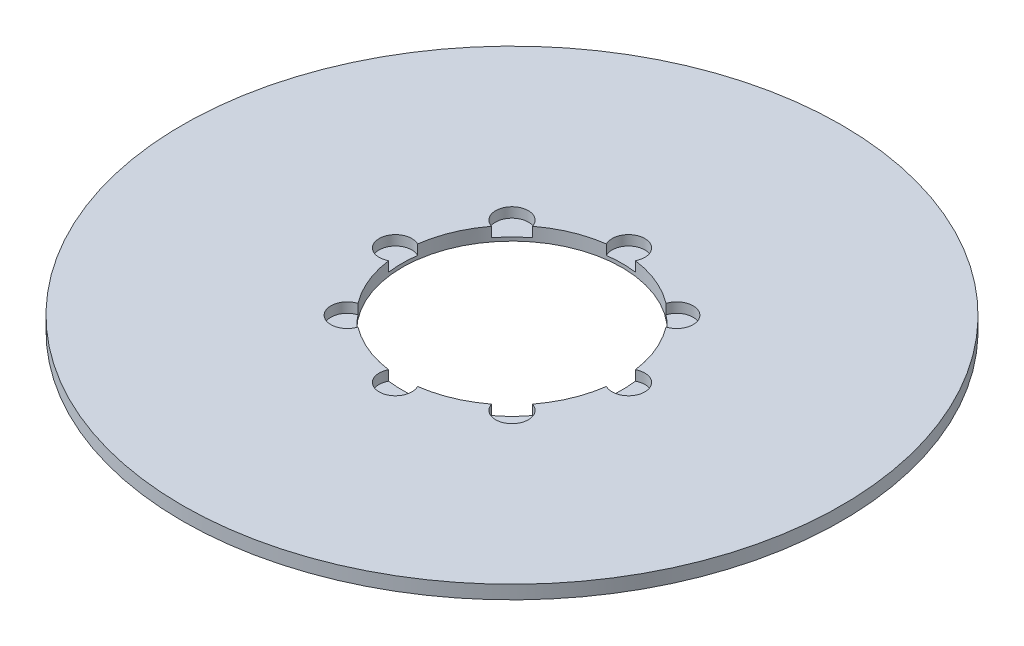
ISO-10303-21;
HEADER;
FILE_DESCRIPTION(('STEP AP214'),'2;1');
FILE_NAME('part.step','',(''),(''),'','','');
FILE_SCHEMA(('AUTOMOTIVE_DESIGN { 1 0 10303 214 1 1 1 1 }'));
ENDSEC;
DATA;
#1=APPLICATION_CONTEXT('core data for automotive mechanical design processes');
#2=APPLICATION_PROTOCOL_DEFINITION('international standard','automotive_design',2000,#1);
#3=PRODUCT_CONTEXT('',#1,'mechanical');
#4=PRODUCT('Part','Part','',(#3));
#5=PRODUCT_RELATED_PRODUCT_CATEGORY('part','',(#4));
#6=PRODUCT_DEFINITION_FORMATION('','',#4);
#7=PRODUCT_DEFINITION_CONTEXT('part definition',#1,'design');
#8=PRODUCT_DEFINITION('design','',#6,#7);
#9=PRODUCT_DEFINITION_SHAPE('','',#8);
#10=(LENGTH_UNIT() NAMED_UNIT(*) SI_UNIT(.MILLI.,.METRE.));
#11=(NAMED_UNIT(*) PLANE_ANGLE_UNIT() SI_UNIT($,.RADIAN.));
#12=(NAMED_UNIT(*) SI_UNIT($,.STERADIAN.) SOLID_ANGLE_UNIT());
#13=UNCERTAINTY_MEASURE_WITH_UNIT(LENGTH_MEASURE(1.E-05),#10,'distance_accuracy_value','');
#14=(GEOMETRIC_REPRESENTATION_CONTEXT(3) GLOBAL_UNCERTAINTY_ASSIGNED_CONTEXT((#13)) GLOBAL_UNIT_ASSIGNED_CONTEXT((#10,
#11,#12)) REPRESENTATION_CONTEXT('',''));
#15=CARTESIAN_POINT('',(0.,0.,0.));
#16=DIRECTION('',(0.,0.,1.));
#17=DIRECTION('',(1.,0.,0.));
#18=AXIS2_PLACEMENT_3D('',#15,#16,#17);
#19=CARTESIAN_POINT('',(0.,4.,0.));
#20=DIRECTION('',(0.,-1.,0.));
#21=DIRECTION('',(0.,0.,-1.));
#22=AXIS2_PLACEMENT_3D('',#19,#20,#21);
#23=CYLINDRICAL_SURFACE('',#22,97.5);
#24=CARTESIAN_POINT('',(0.,4.,0.));
#25=DIRECTION('',(0.,1.,0.));
#26=DIRECTION('',(0.,0.,1.));
#27=AXIS2_PLACEMENT_3D('',#24,#25,#26);
#28=CIRCLE('',#27,97.5);
#29=CARTESIAN_POINT('',(0.,4.,97.5));
#30=VERTEX_POINT('',#29);
#31=EDGE_CURVE('E195',#30,#30,#28,.T.);
#32=ORIENTED_EDGE('',*,*,#31,.F.);
#33=EDGE_LOOP('',(#32));
#34=FACE_BOUND('',#33,.T.);
#35=CARTESIAN_POINT('',(0.,0.,0.));
#36=DIRECTION('',(0.,1.,0.));
#37=DIRECTION('',(0.,0.,1.));
#38=AXIS2_PLACEMENT_3D('',#35,#36,#37);
#39=CIRCLE('',#38,97.5);
#40=CARTESIAN_POINT('',(0.,0.,97.5));
#41=VERTEX_POINT('',#40);
#42=EDGE_CURVE('E179',#41,#41,#39,.T.);
#43=ORIENTED_EDGE('',*,*,#42,.T.);
#44=EDGE_LOOP('',(#43));
#45=FACE_BOUND('',#44,.T.);
#46=ADVANCED_FACE('F39',(#34,#45),#23,.T.);
#47=CARTESIAN_POINT('',(0.,4.,0.));
#48=DIRECTION('',(0.,1.,0.));
#49=DIRECTION('',(0.,0.,1.));
#50=AXIS2_PLACEMENT_3D('',#47,#48,#49);
#51=PLANE('',#50);
#52=CARTESIAN_POINT('',(1.20348579054612E-13,4.,34.4692030043868));
#53=DIRECTION('',(0.,1.,0.));
#54=DIRECTION('',(1.,0.,0.));
#55=AXIS2_PLACEMENT_3D('',#52,#53,#54);
#56=CIRCLE('',#55,4.83518844858543);
#57=CARTESIAN_POINT('',(-4.2786878936029,4.,32.217120136802));
#58=VERTEX_POINT('',#57);
#59=CARTESIAN_POINT('',(4.27868789360313,4.,32.217120136802));
#60=VERTEX_POINT('',#59);
#61=EDGE_CURVE('E176',#58,#60,#56,.T.);
#62=ORIENTED_EDGE('',*,*,#61,.F.);
#63=CARTESIAN_POINT('',(0.,4.,0.));
#64=DIRECTION('',(0.,1.,0.));
#65=DIRECTION('',(0.,0.,1.));
#66=AXIS2_PLACEMENT_3D('',#63,#64,#65);
#67=CIRCLE('',#66,32.5);
#68=CARTESIAN_POINT('',(-19.7554548948869,4.,25.8064333431819));
#69=VERTEX_POINT('',#68);
#70=EDGE_CURVE('E166',#69,#58,#67,.T.);
#71=ORIENTED_EDGE('',*,*,#70,.F.);
#72=CARTESIAN_POINT('',(-24.3734071864976,4.,24.3734071864977));
#73=DIRECTION('',(0.,1.,0.));
#74=DIRECTION('',(0.707106781186549,0.,0.707106781186546));
#75=AXIS2_PLACEMENT_3D('',#72,#73,#74);
#76=CIRCLE('',#75,4.83518844858543);
#77=CARTESIAN_POINT('',(-25.8064333431818,4.,19.755454894887));
#78=VERTEX_POINT('',#77);
#79=EDGE_CURVE('E147',#78,#69,#76,.T.);
#80=ORIENTED_EDGE('',*,*,#79,.F.);
#81=CARTESIAN_POINT('',(-32.217120136802,4.,4.27868789360301));
#82=VERTEX_POINT('',#81);
#83=EDGE_CURVE('E180',#82,#78,#67,.T.);
#84=ORIENTED_EDGE('',*,*,#83,.F.);
#85=CARTESIAN_POINT('',(-34.4692030043868,4.,0.));
#86=DIRECTION('',(0.,1.,0.));
#87=DIRECTION('',(0.,0.,1.));
#88=AXIS2_PLACEMENT_3D('',#85,#86,#87);
#89=CIRCLE('',#88,4.83518844858543);
#90=CARTESIAN_POINT('',(-32.217120136802,4.,-4.27868789360301));
#91=VERTEX_POINT('',#90);
#92=EDGE_CURVE('E186',#91,#82,#89,.T.);
#93=ORIENTED_EDGE('',*,*,#92,.F.);
#94=CARTESIAN_POINT('',(-25.8064333431821,4.,-19.7554548948866));
#95=VERTEX_POINT('',#94);
#96=EDGE_CURVE('E182',#95,#91,#67,.T.);
#97=ORIENTED_EDGE('',*,*,#96,.F.);
#98=CARTESIAN_POINT('',(-24.3734071864979,4.,-24.3734071864973));
#99=DIRECTION('',(0.,1.,0.));
#100=DIRECTION('',(-0.707106781186539,0.,0.707106781186556));
#101=AXIS2_PLACEMENT_3D('',#98,#99,#100);
#102=CIRCLE('',#101,4.83518844858543);
#103=CARTESIAN_POINT('',(-19.7554548948872,4.,-25.8064333431816));
#104=VERTEX_POINT('',#103);
#105=EDGE_CURVE('E446',#104,#95,#102,.T.);
#106=ORIENTED_EDGE('',*,*,#105,.F.);
#107=CARTESIAN_POINT('',(-4.27868789360335,4.,-32.217120136802));
#108=VERTEX_POINT('',#107);
#109=EDGE_CURVE('E452',#108,#104,#67,.T.);
#110=ORIENTED_EDGE('',*,*,#109,.F.);
#111=CARTESIAN_POINT('',(-3.61045737163837E-13,4.,-34.4692030043868));
#112=DIRECTION('',(0.,1.,0.));
#113=DIRECTION('',(-1.,0.,0.));
#114=AXIS2_PLACEMENT_3D('',#111,#112,#113);
#115=CIRCLE('',#114,4.83518844858543);
#116=CARTESIAN_POINT('',(4.27868789360268,4.,-32.2171201368021));
#117=VERTEX_POINT('',#116);
#118=EDGE_CURVE('E477',#117,#108,#115,.T.);
#119=ORIENTED_EDGE('',*,*,#118,.F.);
#120=CARTESIAN_POINT('',(19.7554548948867,4.,-25.806433343182));
#121=VERTEX_POINT('',#120);
#122=EDGE_CURVE('E460',#121,#117,#67,.T.);
#123=ORIENTED_EDGE('',*,*,#122,.F.);
#124=CARTESIAN_POINT('',(24.3734071864974,4.,-24.3734071864979));
#125=DIRECTION('',(0.,1.,0.));
#126=DIRECTION('',(-0.707106781186554,0.,-0.707106781186541));
#127=AXIS2_PLACEMENT_3D('',#124,#125,#126);
#128=CIRCLE('',#127,4.83518844858543);
#129=CARTESIAN_POINT('',(25.8064333431817,4.,-19.7554548948871));
#130=VERTEX_POINT('',#129);
#131=EDGE_CURVE('E464',#130,#121,#128,.T.);
#132=ORIENTED_EDGE('',*,*,#131,.F.);
#133=CARTESIAN_POINT('',(32.217120136802,4.,-4.27868789360301));
#134=VERTEX_POINT('',#133);
#135=EDGE_CURVE('E459',#134,#130,#67,.T.);
#136=ORIENTED_EDGE('',*,*,#135,.F.);
#137=CARTESIAN_POINT('',(34.4692030043868,4.,0.));
#138=DIRECTION('',(0.,1.,0.));
#139=DIRECTION('',(0.,0.,-1.));
#140=AXIS2_PLACEMENT_3D('',#137,#138,#139);
#141=CIRCLE('',#140,4.83518844858543);
#142=CARTESIAN_POINT('',(32.217120136802,4.,4.27868789360301));
#143=VERTEX_POINT('',#142);
#144=EDGE_CURVE('E469',#143,#134,#141,.T.);
#145=ORIENTED_EDGE('',*,*,#144,.F.);
#146=CARTESIAN_POINT('',(25.806433343182,4.,19.7554548948868));
#147=VERTEX_POINT('',#146);
#148=EDGE_CURVE('E181',#147,#143,#67,.T.);
#149=ORIENTED_EDGE('',*,*,#148,.F.);
#150=CARTESIAN_POINT('',(24.3734071864978,4.,24.3734071864975));
#151=DIRECTION('',(0.,1.,0.));
#152=DIRECTION('',(0.707106781186544,0.,-0.707106781186551));
#153=AXIS2_PLACEMENT_3D('',#150,#151,#152);
#154=CIRCLE('',#153,4.83518844858543);
#155=CARTESIAN_POINT('',(19.755454894887,4.,25.8064333431818));
#156=VERTEX_POINT('',#155);
#157=EDGE_CURVE('E475',#156,#147,#154,.T.);
#158=ORIENTED_EDGE('',*,*,#157,.F.);
#159=EDGE_CURVE('E177',#60,#156,#67,.T.);
#160=ORIENTED_EDGE('',*,*,#159,.F.);
#161=EDGE_LOOP('',(#62,#71,#80,#84,#93,#97,#106,#110,#119,#123,#132,#136,#145,#149,#158,#160));
#162=FACE_BOUND('',#161,.T.);
#163=ORIENTED_EDGE('',*,*,#31,.T.);
#164=EDGE_LOOP('',(#163));
#165=FACE_BOUND('',#164,.T.);
#166=ADVANCED_FACE('F172',(#162,#165),#51,.T.);
#167=CARTESIAN_POINT('',(0.,0.,0.));
#168=DIRECTION('',(0.,1.,0.));
#169=DIRECTION('',(0.,0.,1.));
#170=AXIS2_PLACEMENT_3D('',#167,#168,#169);
#171=PLANE('',#170);
#172=CARTESIAN_POINT('',(0.,0.,0.));
#173=DIRECTION('',(0.,1.,0.));
#174=DIRECTION('',(0.,0.,1.));
#175=AXIS2_PLACEMENT_3D('',#172,#173,#174);
#176=CIRCLE('',#175,32.5);
#177=CARTESIAN_POINT('',(0.,0.,32.5));
#178=VERTEX_POINT('',#177);
#179=EDGE_CURVE('E187',#178,#178,#176,.T.);
#180=ORIENTED_EDGE('',*,*,#179,.T.);
#181=EDGE_LOOP('',(#180));
#182=FACE_BOUND('',#181,.T.);
#183=ORIENTED_EDGE('',*,*,#42,.F.);
#184=EDGE_LOOP('',(#183));
#185=FACE_BOUND('',#184,.T.);
#186=ADVANCED_FACE('F270',(#182,#185),#171,.F.);
#187=CARTESIAN_POINT('',(0.,4.,0.));
#188=DIRECTION('',(0.,-1.,0.));
#189=DIRECTION('',(0.,0.,-1.));
#190=AXIS2_PLACEMENT_3D('',#187,#188,#189);
#191=CYLINDRICAL_SURFACE('',#190,32.5);
#192=DIRECTION('',(0.,1.,0.));
#193=VECTOR('',#192,1.);
#194=CARTESIAN_POINT('',(-4.27868789360291,2.53264169819874,32.2171201368021));
#195=LINE('',#194,#193);
#196=CARTESIAN_POINT('',(-4.2786878936029,1.06528339639748,32.217120136802));
#197=VERTEX_POINT('',#196);
#198=EDGE_CURVE('E11',#197,#58,#195,.T.);
#199=ORIENTED_EDGE('',*,*,#198,.F.);
#200=CARTESIAN_POINT('',(0.,1.06528339639748,0.));
#201=DIRECTION('',(0.,1.,0.));
#202=DIRECTION('',(0.,0.,1.));
#203=AXIS2_PLACEMENT_3D('',#200,#201,#202);
#204=CIRCLE('',#203,32.5);
#205=CARTESIAN_POINT('',(4.27868789360313,1.06528339639748,32.217120136802));
#206=VERTEX_POINT('',#205);
#207=EDGE_CURVE('E250',#197,#206,#204,.T.);
#208=ORIENTED_EDGE('',*,*,#207,.T.);
#209=DIRECTION('',(0.,1.,0.));
#210=VECTOR('',#209,1.);
#211=CARTESIAN_POINT('',(4.27868789360313,2.53264169819874,32.217120136802));
#212=LINE('',#211,#210);
#213=EDGE_CURVE('E46',#60,#206,#212,.F.);
#214=ORIENTED_EDGE('',*,*,#213,.F.);
#215=ORIENTED_EDGE('',*,*,#159,.T.);
#216=DIRECTION('',(0.,1.,0.));
#217=VECTOR('',#216,1.);
#218=CARTESIAN_POINT('',(19.755454894887,2.53264169819874,25.8064333431818));
#219=LINE('',#218,#217);
#220=CARTESIAN_POINT('',(19.755454894887,1.06528339639748,25.8064333431818));
#221=VERTEX_POINT('',#220);
#222=EDGE_CURVE('E244',#221,#156,#219,.T.);
#223=ORIENTED_EDGE('',*,*,#222,.F.);
#224=CARTESIAN_POINT('',(0.,1.06528339639748,0.));
#225=DIRECTION('',(0.,1.,0.));
#226=DIRECTION('',(0.,0.,1.));
#227=AXIS2_PLACEMENT_3D('',#224,#225,#226);
#228=CIRCLE('',#227,32.5);
#229=CARTESIAN_POINT('',(25.806433343182,1.06528339639748,19.7554548948868));
#230=VERTEX_POINT('',#229);
#231=EDGE_CURVE('E238',#221,#230,#228,.T.);
#232=ORIENTED_EDGE('',*,*,#231,.T.);
#233=DIRECTION('',(0.,1.,0.));
#234=VECTOR('',#233,1.);
#235=CARTESIAN_POINT('',(25.806433343182,2.53264169819874,19.7554548948868));
#236=LINE('',#235,#234);
#237=EDGE_CURVE('E242',#147,#230,#236,.F.);
#238=ORIENTED_EDGE('',*,*,#237,.F.);
#239=ORIENTED_EDGE('',*,*,#148,.T.);
#240=DIRECTION('',(0.,1.,0.));
#241=VECTOR('',#240,1.);
#242=CARTESIAN_POINT('',(32.217120136802,2.53264169819874,4.27868789360302));
#243=LINE('',#242,#241);
#244=CARTESIAN_POINT('',(32.217120136802,1.06528339639748,4.27868789360301));
#245=VERTEX_POINT('',#244);
#246=EDGE_CURVE('E236',#245,#143,#243,.T.);
#247=ORIENTED_EDGE('',*,*,#246,.F.);
#248=CARTESIAN_POINT('',(0.,1.06528339639748,0.));
#249=DIRECTION('',(0.,1.,0.));
#250=DIRECTION('',(0.,0.,1.));
#251=AXIS2_PLACEMENT_3D('',#248,#249,#250);
#252=CIRCLE('',#251,32.5);
#253=CARTESIAN_POINT('',(32.217120136802,1.06528339639748,-4.27868789360301));
#254=VERTEX_POINT('',#253);
#255=EDGE_CURVE('E235',#245,#254,#252,.T.);
#256=ORIENTED_EDGE('',*,*,#255,.T.);
#257=DIRECTION('',(0.,1.,0.));
#258=VECTOR('',#257,1.);
#259=CARTESIAN_POINT('',(32.217120136802,2.53264169819874,-4.27868789360302));
#260=LINE('',#259,#258);
#261=EDGE_CURVE('E234',#134,#254,#260,.F.);
#262=ORIENTED_EDGE('',*,*,#261,.F.);
#263=ORIENTED_EDGE('',*,*,#135,.T.);
#264=DIRECTION('',(0.,1.,0.));
#265=VECTOR('',#264,1.);
#266=CARTESIAN_POINT('',(25.8064333431817,2.53264169819874,-19.7554548948871));
#267=LINE('',#266,#265);
#268=CARTESIAN_POINT('',(25.8064333431817,1.06528339639748,-19.7554548948871));
#269=VERTEX_POINT('',#268);
#270=EDGE_CURVE('E229',#269,#130,#267,.T.);
#271=ORIENTED_EDGE('',*,*,#270,.F.);
#272=CARTESIAN_POINT('',(0.,1.06528339639748,0.));
#273=DIRECTION('',(0.,1.,0.));
#274=DIRECTION('',(0.,0.,1.));
#275=AXIS2_PLACEMENT_3D('',#272,#273,#274);
#276=CIRCLE('',#275,32.5);
#277=CARTESIAN_POINT('',(19.7554548948867,1.06528339639748,-25.806433343182));
#278=VERTEX_POINT('',#277);
#279=EDGE_CURVE('E221',#269,#278,#276,.T.);
#280=ORIENTED_EDGE('',*,*,#279,.T.);
#281=DIRECTION('',(0.,1.,0.));
#282=VECTOR('',#281,1.);
#283=CARTESIAN_POINT('',(19.7554548948867,2.53264169819874,-25.806433343182));
#284=LINE('',#283,#282);
#285=EDGE_CURVE('E230',#121,#278,#284,.F.);
#286=ORIENTED_EDGE('',*,*,#285,.F.);
#287=ORIENTED_EDGE('',*,*,#122,.T.);
#288=DIRECTION('',(0.,1.,0.));
#289=VECTOR('',#288,1.);
#290=CARTESIAN_POINT('',(4.27868789360268,2.53264169819874,-32.2171201368021));
#291=LINE('',#290,#289);
#292=CARTESIAN_POINT('',(4.27868789360268,1.06528339639748,-32.2171201368021));
#293=VERTEX_POINT('',#292);
#294=EDGE_CURVE('E225',#293,#117,#291,.T.);
#295=ORIENTED_EDGE('',*,*,#294,.F.);
#296=CARTESIAN_POINT('',(0.,1.06528339639748,0.));
#297=DIRECTION('',(0.,1.,0.));
#298=DIRECTION('',(0.,0.,1.));
#299=AXIS2_PLACEMENT_3D('',#296,#297,#298);
#300=CIRCLE('',#299,32.5);
#301=CARTESIAN_POINT('',(-4.27868789360335,1.06528339639748,-32.217120136802));
#302=VERTEX_POINT('',#301);
#303=EDGE_CURVE('E216',#293,#302,#300,.T.);
#304=ORIENTED_EDGE('',*,*,#303,.T.);
#305=DIRECTION('',(0.,1.,0.));
#306=VECTOR('',#305,1.);
#307=CARTESIAN_POINT('',(-4.27868789360336,2.53264169819874,-32.217120136802));
#308=LINE('',#307,#306);
#309=EDGE_CURVE('E218',#108,#302,#308,.F.);
#310=ORIENTED_EDGE('',*,*,#309,.F.);
#311=ORIENTED_EDGE('',*,*,#109,.T.);
#312=DIRECTION('',(0.,1.,0.));
#313=VECTOR('',#312,1.);
#314=CARTESIAN_POINT('',(-19.7554548948872,2.53264169819874,-25.8064333431816));
#315=LINE('',#314,#313);
#316=CARTESIAN_POINT('',(-19.7554548948872,1.06528339639748,-25.8064333431816));
#317=VERTEX_POINT('',#316);
#318=EDGE_CURVE('E212',#317,#104,#315,.T.);
#319=ORIENTED_EDGE('',*,*,#318,.F.);
#320=CARTESIAN_POINT('',(0.,1.06528339639748,0.));
#321=DIRECTION('',(0.,1.,0.));
#322=DIRECTION('',(0.,0.,1.));
#323=AXIS2_PLACEMENT_3D('',#320,#321,#322);
#324=CIRCLE('',#323,32.5);
#325=CARTESIAN_POINT('',(-25.8064333431821,1.06528339639748,-19.7554548948866));
#326=VERTEX_POINT('',#325);
#327=EDGE_CURVE('E208',#317,#326,#324,.T.);
#328=ORIENTED_EDGE('',*,*,#327,.T.);
#329=DIRECTION('',(0.,1.,0.));
#330=VECTOR('',#329,1.);
#331=CARTESIAN_POINT('',(-25.8064333431821,2.53264169819874,-19.7554548948866));
#332=LINE('',#331,#330);
#333=EDGE_CURVE('E211',#95,#326,#332,.F.);
#334=ORIENTED_EDGE('',*,*,#333,.F.);
#335=ORIENTED_EDGE('',*,*,#96,.T.);
#336=DIRECTION('',(0.,1.,0.));
#337=VECTOR('',#336,1.);
#338=CARTESIAN_POINT('',(-32.217120136802,2.53264169819874,-4.27868789360302));
#339=LINE('',#338,#337);
#340=CARTESIAN_POINT('',(-32.217120136802,1.06528339639748,-4.27868789360301));
#341=VERTEX_POINT('',#340);
#342=EDGE_CURVE('E201',#341,#91,#339,.T.);
#343=ORIENTED_EDGE('',*,*,#342,.F.);
#344=CARTESIAN_POINT('',(0.,1.06528339639748,0.));
#345=DIRECTION('',(0.,1.,0.));
#346=DIRECTION('',(0.,0.,1.));
#347=AXIS2_PLACEMENT_3D('',#344,#345,#346);
#348=CIRCLE('',#347,32.5);
#349=CARTESIAN_POINT('',(-32.217120136802,1.06528339639748,4.27868789360301));
#350=VERTEX_POINT('',#349);
#351=EDGE_CURVE('E194',#341,#350,#348,.T.);
#352=ORIENTED_EDGE('',*,*,#351,.T.);
#353=DIRECTION('',(0.,1.,0.));
#354=VECTOR('',#353,1.);
#355=CARTESIAN_POINT('',(-32.217120136802,2.53264169819874,4.27868789360302));
#356=LINE('',#355,#354);
#357=EDGE_CURVE('E199',#82,#350,#356,.F.);
#358=ORIENTED_EDGE('',*,*,#357,.F.);
#359=ORIENTED_EDGE('',*,*,#83,.T.);
#360=DIRECTION('',(0.,1.,0.));
#361=VECTOR('',#360,1.);
#362=CARTESIAN_POINT('',(-25.8064333431818,2.53264169819874,19.755454894887));
#363=LINE('',#362,#361);
#364=CARTESIAN_POINT('',(-25.8064333431818,1.06528339639748,19.755454894887));
#365=VERTEX_POINT('',#364);
#366=EDGE_CURVE('E160',#365,#78,#363,.T.);
#367=ORIENTED_EDGE('',*,*,#366,.F.);
#368=CARTESIAN_POINT('',(0.,1.06528339639748,0.));
#369=DIRECTION('',(0.,1.,0.));
#370=DIRECTION('',(0.,0.,1.));
#371=AXIS2_PLACEMENT_3D('',#368,#369,#370);
#372=CIRCLE('',#371,32.5);
#373=CARTESIAN_POINT('',(-19.7554548948869,1.06528339639748,25.8064333431819));
#374=VERTEX_POINT('',#373);
#375=EDGE_CURVE('E168',#365,#374,#372,.T.);
#376=ORIENTED_EDGE('',*,*,#375,.T.);
#377=DIRECTION('',(0.,1.,0.));
#378=VECTOR('',#377,1.);
#379=CARTESIAN_POINT('',(-19.7554548948869,2.53264169819874,25.8064333431819));
#380=LINE('',#379,#378);
#381=EDGE_CURVE('E152',#69,#374,#380,.F.);
#382=ORIENTED_EDGE('',*,*,#381,.F.);
#383=ORIENTED_EDGE('',*,*,#70,.T.);
#384=EDGE_LOOP('',(#199,#208,#214,#215,#223,#232,#238,#239,#247,#256,#262,#263,#271,#280,#286,
#287,#295,#304,#310,#311,#319,#328,#334,#335,#343,#352,#358,#359,#367,#376,#382,#383));
#385=FACE_BOUND('',#384,.T.);
#386=ORIENTED_EDGE('',*,*,#179,.F.);
#387=EDGE_LOOP('',(#386));
#388=FACE_BOUND('',#387,.T.);
#389=ADVANCED_FACE('F170',(#385,#388),#191,.F.);
#390=CARTESIAN_POINT('',(-34.4692030043868,1.06528339639748,0.));
#391=DIRECTION('',(0.,1.,0.));
#392=DIRECTION('',(0.,0.,1.));
#393=AXIS2_PLACEMENT_3D('',#390,#391,#392);
#394=CYLINDRICAL_SURFACE('',#393,4.83518844858543);
#395=ORIENTED_EDGE('',*,*,#342,.T.);
#396=ORIENTED_EDGE('',*,*,#92,.T.);
#397=ORIENTED_EDGE('',*,*,#357,.T.);
#398=CARTESIAN_POINT('',(-34.4692030043868,1.06528339639748,0.));
#399=DIRECTION('',(0.,1.,0.));
#400=DIRECTION('',(0.,0.,1.));
#401=AXIS2_PLACEMENT_3D('',#398,#399,#400);
#402=CIRCLE('',#401,4.83518844858543);
#403=EDGE_CURVE('E191',#341,#350,#402,.T.);
#404=ORIENTED_EDGE('',*,*,#403,.F.);
#405=EDGE_LOOP('',(#395,#396,#397,#404));
#406=FACE_BOUND('',#405,.T.);
#407=ADVANCED_FACE('F279',(#406),#394,.F.);
#408=CARTESIAN_POINT('',(-34.4692030043868,1.06528339639748,0.));
#409=DIRECTION('',(0.,1.,0.));
#410=DIRECTION('',(0.,0.,1.));
#411=AXIS2_PLACEMENT_3D('',#408,#409,#410);
#412=PLANE('',#411);
#413=ORIENTED_EDGE('',*,*,#403,.T.);
#414=ORIENTED_EDGE('',*,*,#351,.F.);
#415=EDGE_LOOP('',(#413,#414));
#416=FACE_BOUND('',#415,.T.);
#417=ADVANCED_FACE('F285',(#416),#412,.T.);
#418=CARTESIAN_POINT('',(-24.3734071864976,1.06528339639748,24.3734071864977));
#419=DIRECTION('',(0.,1.,0.));
#420=DIRECTION('',(0.,0.,1.));
#421=AXIS2_PLACEMENT_3D('',#418,#419,#420);
#422=CYLINDRICAL_SURFACE('',#421,4.83518844858543);
#423=ORIENTED_EDGE('',*,*,#366,.T.);
#424=ORIENTED_EDGE('',*,*,#79,.T.);
#425=ORIENTED_EDGE('',*,*,#381,.T.);
#426=CARTESIAN_POINT('',(-24.3734071864976,1.06528339639748,24.3734071864977));
#427=DIRECTION('',(0.,1.,0.));
#428=DIRECTION('',(0.707106781186549,0.,0.707106781186546));
#429=AXIS2_PLACEMENT_3D('',#426,#427,#428);
#430=CIRCLE('',#429,4.83518844858543);
#431=EDGE_CURVE('E165',#365,#374,#430,.T.);
#432=ORIENTED_EDGE('',*,*,#431,.F.);
#433=EDGE_LOOP('',(#423,#424,#425,#432));
#434=FACE_BOUND('',#433,.T.);
#435=ADVANCED_FACE('F155',(#434),#422,.F.);
#436=CARTESIAN_POINT('',(-24.3734071864976,1.06528339639748,24.3734071864977));
#437=DIRECTION('',(0.,1.,0.));
#438=DIRECTION('',(0.707106781186549,0.,0.707106781186546));
#439=AXIS2_PLACEMENT_3D('',#436,#437,#438);
#440=PLANE('',#439);
#441=ORIENTED_EDGE('',*,*,#431,.T.);
#442=ORIENTED_EDGE('',*,*,#375,.F.);
#443=EDGE_LOOP('',(#441,#442));
#444=FACE_BOUND('',#443,.T.);
#445=ADVANCED_FACE('F288',(#444),#440,.T.);
#446=CARTESIAN_POINT('',(-24.3734071864979,1.06528339639748,-24.3734071864973));
#447=DIRECTION('',(0.,1.,0.));
#448=DIRECTION('',(0.,0.,1.));
#449=AXIS2_PLACEMENT_3D('',#446,#447,#448);
#450=CYLINDRICAL_SURFACE('',#449,4.83518844858543);
#451=ORIENTED_EDGE('',*,*,#318,.T.);
#452=ORIENTED_EDGE('',*,*,#105,.T.);
#453=ORIENTED_EDGE('',*,*,#333,.T.);
#454=CARTESIAN_POINT('',(-24.3734071864979,1.06528339639748,-24.3734071864973));
#455=DIRECTION('',(0.,1.,0.));
#456=DIRECTION('',(-0.707106781186539,0.,0.707106781186556));
#457=AXIS2_PLACEMENT_3D('',#454,#455,#456);
#458=CIRCLE('',#457,4.83518844858543);
#459=EDGE_CURVE('E447',#317,#326,#458,.T.);
#460=ORIENTED_EDGE('',*,*,#459,.F.);
#461=EDGE_LOOP('',(#451,#452,#453,#460));
#462=FACE_BOUND('',#461,.T.);
#463=ADVANCED_FACE('F295',(#462),#450,.F.);
#464=CARTESIAN_POINT('',(-24.3734071864979,1.06528339639748,-24.3734071864973));
#465=DIRECTION('',(0.,1.,0.));
#466=DIRECTION('',(-0.707106781186539,0.,0.707106781186556));
#467=AXIS2_PLACEMENT_3D('',#464,#465,#466);
#468=PLANE('',#467);
#469=ORIENTED_EDGE('',*,*,#459,.T.);
#470=ORIENTED_EDGE('',*,*,#327,.F.);
#471=EDGE_LOOP('',(#469,#470));
#472=FACE_BOUND('',#471,.T.);
#473=ADVANCED_FACE('F375',(#472),#468,.T.);
#474=CARTESIAN_POINT('',(-3.61045737163837E-13,1.06528339639748,-34.4692030043868));
#475=DIRECTION('',(0.,1.,0.));
#476=DIRECTION('',(0.,0.,1.));
#477=AXIS2_PLACEMENT_3D('',#474,#475,#476);
#478=CYLINDRICAL_SURFACE('',#477,4.83518844858543);
#479=ORIENTED_EDGE('',*,*,#294,.T.);
#480=ORIENTED_EDGE('',*,*,#118,.T.);
#481=ORIENTED_EDGE('',*,*,#309,.T.);
#482=CARTESIAN_POINT('',(-3.61045737163837E-13,1.06528339639748,-34.4692030043868));
#483=DIRECTION('',(0.,1.,0.));
#484=DIRECTION('',(-1.,0.,0.));
#485=AXIS2_PLACEMENT_3D('',#482,#483,#484);
#486=CIRCLE('',#485,4.83518844858543);
#487=EDGE_CURVE('E467',#293,#302,#486,.T.);
#488=ORIENTED_EDGE('',*,*,#487,.F.);
#489=EDGE_LOOP('',(#479,#480,#481,#488));
#490=FACE_BOUND('',#489,.T.);
#491=ADVANCED_FACE('F361',(#490),#478,.F.);
#492=CARTESIAN_POINT('',(-3.61045737163837E-13,1.06528339639748,-34.4692030043868));
#493=DIRECTION('',(0.,1.,0.));
#494=DIRECTION('',(-1.,0.,0.));
#495=AXIS2_PLACEMENT_3D('',#492,#493,#494);
#496=PLANE('',#495);
#497=ORIENTED_EDGE('',*,*,#487,.T.);
#498=ORIENTED_EDGE('',*,*,#303,.F.);
#499=EDGE_LOOP('',(#497,#498));
#500=FACE_BOUND('',#499,.T.);
#501=ADVANCED_FACE('F297',(#500),#496,.T.);
#502=CARTESIAN_POINT('',(24.3734071864974,1.06528339639748,-24.3734071864979));
#503=DIRECTION('',(0.,1.,0.));
#504=DIRECTION('',(0.,0.,1.));
#505=AXIS2_PLACEMENT_3D('',#502,#503,#504);
#506=CYLINDRICAL_SURFACE('',#505,4.83518844858543);
#507=ORIENTED_EDGE('',*,*,#270,.T.);
#508=ORIENTED_EDGE('',*,*,#131,.T.);
#509=ORIENTED_EDGE('',*,*,#285,.T.);
#510=CARTESIAN_POINT('',(24.3734071864974,1.06528339639748,-24.3734071864979));
#511=DIRECTION('',(0.,1.,0.));
#512=DIRECTION('',(-0.707106781186554,0.,-0.707106781186541));
#513=AXIS2_PLACEMENT_3D('',#510,#511,#512);
#514=CIRCLE('',#513,4.83518844858543);
#515=EDGE_CURVE('E470',#269,#278,#514,.T.);
#516=ORIENTED_EDGE('',*,*,#515,.F.);
#517=EDGE_LOOP('',(#507,#508,#509,#516));
#518=FACE_BOUND('',#517,.T.);
#519=ADVANCED_FACE('F294',(#518),#506,.F.);
#520=CARTESIAN_POINT('',(24.3734071864974,1.06528339639748,-24.3734071864979));
#521=DIRECTION('',(0.,1.,0.));
#522=DIRECTION('',(-0.707106781186554,0.,-0.707106781186541));
#523=AXIS2_PLACEMENT_3D('',#520,#521,#522);
#524=PLANE('',#523);
#525=ORIENTED_EDGE('',*,*,#515,.T.);
#526=ORIENTED_EDGE('',*,*,#279,.F.);
#527=EDGE_LOOP('',(#525,#526));
#528=FACE_BOUND('',#527,.T.);
#529=ADVANCED_FACE('F300',(#528),#524,.T.);
#530=CARTESIAN_POINT('',(34.4692030043868,1.06528339639748,0.));
#531=DIRECTION('',(0.,1.,0.));
#532=DIRECTION('',(0.,0.,1.));
#533=AXIS2_PLACEMENT_3D('',#530,#531,#532);
#534=CYLINDRICAL_SURFACE('',#533,4.83518844858543);
#535=ORIENTED_EDGE('',*,*,#246,.T.);
#536=ORIENTED_EDGE('',*,*,#144,.T.);
#537=ORIENTED_EDGE('',*,*,#261,.T.);
#538=CARTESIAN_POINT('',(34.4692030043868,1.06528339639748,0.));
#539=DIRECTION('',(0.,1.,0.));
#540=DIRECTION('',(0.,0.,-1.));
#541=AXIS2_PLACEMENT_3D('',#538,#539,#540);
#542=CIRCLE('',#541,4.83518844858543);
#543=EDGE_CURVE('E472',#245,#254,#542,.T.);
#544=ORIENTED_EDGE('',*,*,#543,.F.);
#545=EDGE_LOOP('',(#535,#536,#537,#544));
#546=FACE_BOUND('',#545,.T.);
#547=ADVANCED_FACE('F305',(#546),#534,.F.);
#548=CARTESIAN_POINT('',(34.4692030043868,1.06528339639748,0.));
#549=DIRECTION('',(0.,1.,0.));
#550=DIRECTION('',(0.,0.,-1.));
#551=AXIS2_PLACEMENT_3D('',#548,#549,#550);
#552=PLANE('',#551);
#553=ORIENTED_EDGE('',*,*,#543,.T.);
#554=ORIENTED_EDGE('',*,*,#255,.F.);
#555=EDGE_LOOP('',(#553,#554));
#556=FACE_BOUND('',#555,.T.);
#557=ADVANCED_FACE('F308',(#556),#552,.T.);
#558=CARTESIAN_POINT('',(24.3734071864978,1.06528339639748,24.3734071864975));
#559=DIRECTION('',(0.,1.,0.));
#560=DIRECTION('',(0.,0.,1.));
#561=AXIS2_PLACEMENT_3D('',#558,#559,#560);
#562=CYLINDRICAL_SURFACE('',#561,4.83518844858543);
#563=ORIENTED_EDGE('',*,*,#222,.T.);
#564=ORIENTED_EDGE('',*,*,#157,.T.);
#565=ORIENTED_EDGE('',*,*,#237,.T.);
#566=CARTESIAN_POINT('',(24.3734071864978,1.06528339639748,24.3734071864975));
#567=DIRECTION('',(0.,1.,0.));
#568=DIRECTION('',(0.707106781186544,0.,-0.707106781186551));
#569=AXIS2_PLACEMENT_3D('',#566,#567,#568);
#570=CIRCLE('',#569,4.83518844858543);
#571=EDGE_CURVE('E56',#221,#230,#570,.T.);
#572=ORIENTED_EDGE('',*,*,#571,.F.);
#573=EDGE_LOOP('',(#563,#564,#565,#572));
#574=FACE_BOUND('',#573,.T.);
#575=ADVANCED_FACE('F309',(#574),#562,.F.);
#576=CARTESIAN_POINT('',(24.3734071864978,1.06528339639748,24.3734071864975));
#577=DIRECTION('',(0.,1.,0.));
#578=DIRECTION('',(0.707106781186544,0.,-0.707106781186551));
#579=AXIS2_PLACEMENT_3D('',#576,#577,#578);
#580=PLANE('',#579);
#581=ORIENTED_EDGE('',*,*,#571,.T.);
#582=ORIENTED_EDGE('',*,*,#231,.F.);
#583=EDGE_LOOP('',(#581,#582));
#584=FACE_BOUND('',#583,.T.);
#585=ADVANCED_FACE('F256',(#584),#580,.T.);
#586=CARTESIAN_POINT('',(1.20348579054612E-13,1.06528339639748,34.4692030043868));
#587=DIRECTION('',(0.,1.,0.));
#588=DIRECTION('',(0.,0.,1.));
#589=AXIS2_PLACEMENT_3D('',#586,#587,#588);
#590=CYLINDRICAL_SURFACE('',#589,4.83518844858543);
#591=ORIENTED_EDGE('',*,*,#198,.T.);
#592=ORIENTED_EDGE('',*,*,#61,.T.);
#593=ORIENTED_EDGE('',*,*,#213,.T.);
#594=CARTESIAN_POINT('',(1.20348579054612E-13,1.06528339639748,34.4692030043868));
#595=DIRECTION('',(0.,1.,0.));
#596=DIRECTION('',(1.,0.,0.));
#597=AXIS2_PLACEMENT_3D('',#594,#595,#596);
#598=CIRCLE('',#597,4.83518844858543);
#599=EDGE_CURVE('E55',#197,#206,#598,.T.);
#600=ORIENTED_EDGE('',*,*,#599,.F.);
#601=EDGE_LOOP('',(#591,#592,#593,#600));
#602=FACE_BOUND('',#601,.T.);
#603=ADVANCED_FACE('F253',(#602),#590,.F.);
#604=CARTESIAN_POINT('',(1.20348579054612E-13,1.06528339639748,34.4692030043868));
#605=DIRECTION('',(0.,1.,0.));
#606=DIRECTION('',(1.,0.,0.));
#607=AXIS2_PLACEMENT_3D('',#604,#605,#606);
#608=PLANE('',#607);
#609=ORIENTED_EDGE('',*,*,#599,.T.);
#610=ORIENTED_EDGE('',*,*,#207,.F.);
#611=EDGE_LOOP('',(#609,#610));
#612=FACE_BOUND('',#611,.T.);
#613=ADVANCED_FACE('F252',(#612),#608,.T.);
#614=CLOSED_SHELL('',(#46,#166,#186,#389,#407,#417,#435,#445,#463,#473,#491,#501,#519,#529,#547,
#557,#575,#585,#603,#613));
#615=MANIFOLD_SOLID_BREP('B2',#614);
#616=ADVANCED_BREP_SHAPE_REPRESENTATION('',(#18,#615),#14);
#617=SHAPE_DEFINITION_REPRESENTATION(#9,#616);
ENDSEC;
END-ISO-10303-21;
